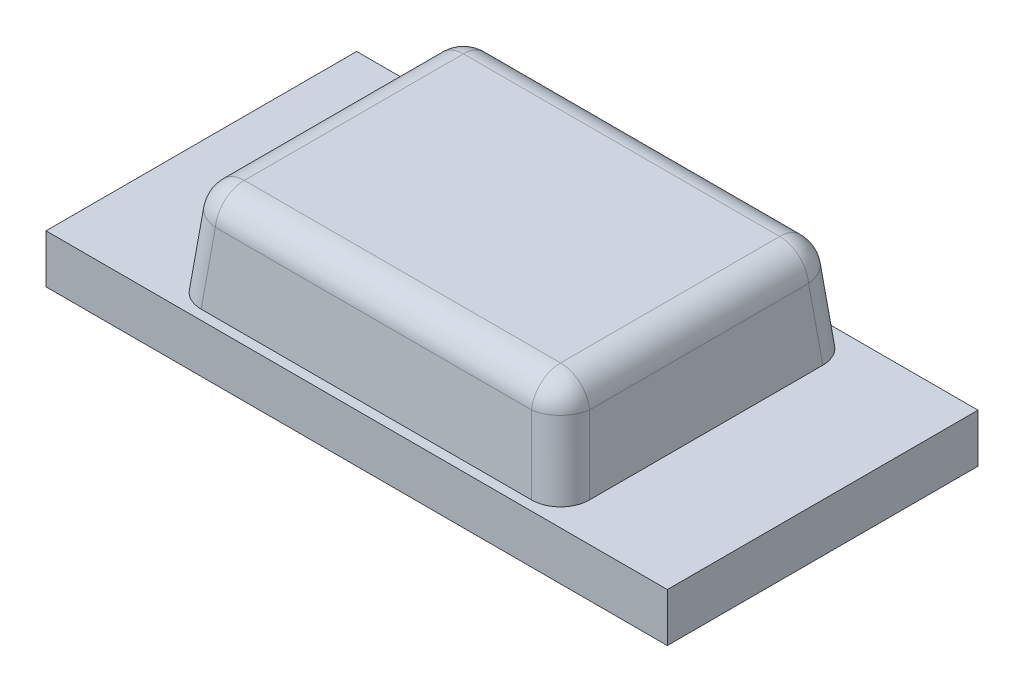
ISO-10303-21;
HEADER;
FILE_DESCRIPTION(('STEP AP214'),'2;1');
FILE_NAME('part.step','',(''),(''),'','','');
FILE_SCHEMA(('AUTOMOTIVE_DESIGN { 1 0 10303 214 1 1 1 1 }'));
ENDSEC;
DATA;
#1=APPLICATION_CONTEXT('core data for automotive mechanical design processes');
#2=APPLICATION_PROTOCOL_DEFINITION('international standard','automotive_design',2000,#1);
#3=PRODUCT_CONTEXT('',#1,'mechanical');
#4=PRODUCT('Part','Part','',(#3));
#5=PRODUCT_RELATED_PRODUCT_CATEGORY('part','',(#4));
#6=PRODUCT_DEFINITION_FORMATION('','',#4);
#7=PRODUCT_DEFINITION_CONTEXT('part definition',#1,'design');
#8=PRODUCT_DEFINITION('design','',#6,#7);
#9=PRODUCT_DEFINITION_SHAPE('','',#8);
#10=(LENGTH_UNIT() NAMED_UNIT(*) SI_UNIT(.MILLI.,.METRE.));
#11=(NAMED_UNIT(*) PLANE_ANGLE_UNIT() SI_UNIT($,.RADIAN.));
#12=(NAMED_UNIT(*) SI_UNIT($,.STERADIAN.) SOLID_ANGLE_UNIT());
#13=UNCERTAINTY_MEASURE_WITH_UNIT(LENGTH_MEASURE(1.E-05),#10,'distance_accuracy_value','');
#14=(GEOMETRIC_REPRESENTATION_CONTEXT(3) GLOBAL_UNCERTAINTY_ASSIGNED_CONTEXT((#13)) GLOBAL_UNIT_ASSIGNED_CONTEXT((#10,
#11,#12)) REPRESENTATION_CONTEXT('',''));
#15=CARTESIAN_POINT('',(0.,0.,0.));
#16=DIRECTION('',(0.,0.,1.));
#17=DIRECTION('',(1.,0.,0.));
#18=AXIS2_PLACEMENT_3D('',#15,#16,#17);
#19=CARTESIAN_POINT('',(0.,0.25,0.));
#20=DIRECTION('',(0.,-1.,0.));
#21=DIRECTION('',(0.,0.,-1.));
#22=AXIS2_PLACEMENT_3D('',#19,#20,#21);
#23=PLANE('',#22);
#24=DIRECTION('',(0.,0.,-1.));
#25=VECTOR('',#24,1.);
#26=CARTESIAN_POINT('',(1.6,0.25,0.799999999999998));
#27=LINE('',#26,#25);
#28=CARTESIAN_POINT('',(1.6,0.25,0.799999999999998));
#29=VERTEX_POINT('',#28);
#30=CARTESIAN_POINT('',(1.6,0.25,-0.800000000000002));
#31=VERTEX_POINT('',#30);
#32=EDGE_CURVE('E145',#29,#31,#27,.T.);
#33=ORIENTED_EDGE('',*,*,#32,.T.);
#34=DIRECTION('',(-1.,0.,0.));
#35=VECTOR('',#34,1.);
#36=CARTESIAN_POINT('',(-1.6,0.25,-0.800000000000002));
#37=LINE('',#36,#35);
#38=CARTESIAN_POINT('',(-1.6,0.25,-0.800000000000002));
#39=VERTEX_POINT('',#38);
#40=EDGE_CURVE('E134',#31,#39,#37,.T.);
#41=ORIENTED_EDGE('',*,*,#40,.T.);
#42=DIRECTION('',(0.,0.,1.));
#43=VECTOR('',#42,1.);
#44=CARTESIAN_POINT('',(-1.6,0.25,0.799999999999998));
#45=LINE('',#44,#43);
#46=CARTESIAN_POINT('',(-1.6,0.25,0.799999999999998));
#47=VERTEX_POINT('',#46);
#48=EDGE_CURVE('E144',#39,#47,#45,.T.);
#49=ORIENTED_EDGE('',*,*,#48,.T.);
#50=DIRECTION('',(1.,0.,0.));
#51=VECTOR('',#50,1.);
#52=CARTESIAN_POINT('',(-1.6,0.25,0.799999999999998));
#53=LINE('',#52,#51);
#54=EDGE_CURVE('E150',#47,#29,#53,.T.);
#55=ORIENTED_EDGE('',*,*,#54,.T.);
#56=EDGE_LOOP('',(#33,#41,#49,#55));
#57=FACE_BOUND('',#56,.T.);
#58=DIRECTION('',(0.,0.,-1.));
#59=VECTOR('',#58,1.);
#60=CARTESIAN_POINT('',(1.,0.25,0.750000000000002));
#61=LINE('',#60,#59);
#62=CARTESIAN_POINT('',(1.,0.25,0.600744266964108));
#63=VERTEX_POINT('',#62);
#64=CARTESIAN_POINT('',(1.,0.25,-0.600744266964107));
#65=VERTEX_POINT('',#64);
#66=EDGE_CURVE('E234',#63,#65,#61,.T.);
#67=ORIENTED_EDGE('',*,*,#66,.F.);
#68=CARTESIAN_POINT('',(0.849252021732466,0.25,0.599252021732468));
#69=DIRECTION('',(0.,-1.,0.));
#70=DIRECTION('',(0.707106781186548,0.,0.707106781186548));
#71=AXIS2_PLACEMENT_3D('',#68,#69,#70);
#72=ELLIPSE('',#71,0.151492263510379,0.15);
#73=CARTESIAN_POINT('',(0.850744266964105,0.25,0.750000000000002));
#74=VERTEX_POINT('',#73);
#75=EDGE_CURVE('E41',#63,#74,#72,.T.);
#76=ORIENTED_EDGE('',*,*,#75,.T.);
#77=DIRECTION('',(1.,0.,0.));
#78=VECTOR('',#77,1.);
#79=CARTESIAN_POINT('',(-1.,0.25,0.750000000000002));
#80=LINE('',#79,#78);
#81=CARTESIAN_POINT('',(-0.850744266964105,0.25,0.750000000000002));
#82=VERTEX_POINT('',#81);
#83=EDGE_CURVE('E245',#82,#74,#80,.T.);
#84=ORIENTED_EDGE('',*,*,#83,.F.);
#85=CARTESIAN_POINT('',(-0.849252021732466,0.25,0.599252021732468));
#86=DIRECTION('',(0.,-1.,0.));
#87=DIRECTION('',(-0.707106781186548,0.,0.707106781186548));
#88=AXIS2_PLACEMENT_3D('',#85,#86,#87);
#89=ELLIPSE('',#88,0.151492263510379,0.15);
#90=CARTESIAN_POINT('',(-1.,0.25,0.600744266964108));
#91=VERTEX_POINT('',#90);
#92=EDGE_CURVE('E11',#82,#91,#89,.T.);
#93=ORIENTED_EDGE('',*,*,#92,.T.);
#94=DIRECTION('',(0.,0.,1.));
#95=VECTOR('',#94,1.);
#96=CARTESIAN_POINT('',(-1.,0.25,0.750000000000002));
#97=LINE('',#96,#95);
#98=CARTESIAN_POINT('',(-1.,0.25,-0.600744266964107));
#99=VERTEX_POINT('',#98);
#100=EDGE_CURVE('E240',#99,#91,#97,.T.);
#101=ORIENTED_EDGE('',*,*,#100,.F.);
#102=CARTESIAN_POINT('',(-0.849252021732466,0.25,-0.599252021732468));
#103=DIRECTION('',(0.,-1.,0.));
#104=DIRECTION('',(-0.707106781186548,0.,-0.707106781186548));
#105=AXIS2_PLACEMENT_3D('',#102,#103,#104);
#106=ELLIPSE('',#105,0.151492263510379,0.15);
#107=CARTESIAN_POINT('',(-0.850744266964105,0.25,-0.750000000000002));
#108=VERTEX_POINT('',#107);
#109=EDGE_CURVE('E196',#99,#108,#106,.T.);
#110=ORIENTED_EDGE('',*,*,#109,.T.);
#111=DIRECTION('',(-1.,0.,0.));
#112=VECTOR('',#111,1.);
#113=CARTESIAN_POINT('',(-1.,0.25,-0.750000000000002));
#114=LINE('',#113,#112);
#115=CARTESIAN_POINT('',(0.850744266964105,0.25,-0.750000000000002));
#116=VERTEX_POINT('',#115);
#117=EDGE_CURVE('E236',#116,#108,#114,.T.);
#118=ORIENTED_EDGE('',*,*,#117,.F.);
#119=CARTESIAN_POINT('',(0.849252021732466,0.25,-0.599252021732468));
#120=DIRECTION('',(0.,-1.,0.));
#121=DIRECTION('',(0.707106781186548,0.,-0.707106781186548));
#122=AXIS2_PLACEMENT_3D('',#119,#120,#121);
#123=ELLIPSE('',#122,0.151492263510379,0.15);
#124=EDGE_CURVE('E198',#116,#65,#123,.T.);
#125=ORIENTED_EDGE('',*,*,#124,.T.);
#126=EDGE_LOOP('',(#67,#76,#84,#93,#101,#110,#118,#125));
#127=FACE_BOUND('',#126,.T.);
#128=ADVANCED_FACE('F32',(#57,#127),#23,.F.);
#129=CARTESIAN_POINT('',(1.6,0.25,0.799999999999998));
#130=DIRECTION('',(-1.,0.,0.));
#131=DIRECTION('',(0.,0.,1.));
#132=AXIS2_PLACEMENT_3D('',#129,#130,#131);
#133=PLANE('',#132);
#134=DIRECTION('',(0.,0.,-1.));
#135=VECTOR('',#134,1.);
#136=CARTESIAN_POINT('',(1.6,0.,0.799999999999998));
#137=LINE('',#136,#135);
#138=CARTESIAN_POINT('',(1.6,0.,0.799999999999998));
#139=VERTEX_POINT('',#138);
#140=CARTESIAN_POINT('',(1.6,0.,-0.800000000000002));
#141=VERTEX_POINT('',#140);
#142=EDGE_CURVE('E158',#139,#141,#137,.T.);
#143=ORIENTED_EDGE('',*,*,#142,.T.);
#144=DIRECTION('',(0.,-1.,0.));
#145=VECTOR('',#144,1.);
#146=CARTESIAN_POINT('',(1.6,0.25,-0.800000000000002));
#147=LINE('',#146,#145);
#148=EDGE_CURVE('E138',#31,#141,#147,.T.);
#149=ORIENTED_EDGE('',*,*,#148,.F.);
#150=ORIENTED_EDGE('',*,*,#32,.F.);
#151=DIRECTION('',(0.,-1.,0.));
#152=VECTOR('',#151,1.);
#153=CARTESIAN_POINT('',(1.6,0.25,0.799999999999998));
#154=LINE('',#153,#152);
#155=EDGE_CURVE('E250',#29,#139,#154,.T.);
#156=ORIENTED_EDGE('',*,*,#155,.T.);
#157=EDGE_LOOP('',(#143,#149,#150,#156));
#158=FACE_BOUND('',#157,.T.);
#159=ADVANCED_FACE('F156',(#158),#133,.F.);
#160=CARTESIAN_POINT('',(-1.6,0.25,-0.800000000000002));
#161=DIRECTION('',(0.,0.,1.));
#162=DIRECTION('',(1.,0.,0.));
#163=AXIS2_PLACEMENT_3D('',#160,#161,#162);
#164=PLANE('',#163);
#165=DIRECTION('',(-1.,0.,0.));
#166=VECTOR('',#165,1.);
#167=CARTESIAN_POINT('',(-1.6,0.,-0.800000000000002));
#168=LINE('',#167,#166);
#169=CARTESIAN_POINT('',(-1.6,0.,-0.800000000000002));
#170=VERTEX_POINT('',#169);
#171=EDGE_CURVE('E252',#141,#170,#168,.T.);
#172=ORIENTED_EDGE('',*,*,#171,.T.);
#173=DIRECTION('',(0.,-1.,0.));
#174=VECTOR('',#173,1.);
#175=CARTESIAN_POINT('',(-1.6,0.25,-0.800000000000002));
#176=LINE('',#175,#174);
#177=EDGE_CURVE('E141',#39,#170,#176,.T.);
#178=ORIENTED_EDGE('',*,*,#177,.F.);
#179=ORIENTED_EDGE('',*,*,#40,.F.);
#180=ORIENTED_EDGE('',*,*,#148,.T.);
#181=EDGE_LOOP('',(#172,#178,#179,#180));
#182=FACE_BOUND('',#181,.T.);
#183=ADVANCED_FACE('F136',(#182),#164,.F.);
#184=CARTESIAN_POINT('',(-1.6,0.25,0.799999999999998));
#185=DIRECTION('',(1.,0.,0.));
#186=DIRECTION('',(0.,0.,-1.));
#187=AXIS2_PLACEMENT_3D('',#184,#185,#186);
#188=PLANE('',#187);
#189=DIRECTION('',(0.,0.,1.));
#190=VECTOR('',#189,1.);
#191=CARTESIAN_POINT('',(-1.6,0.,0.799999999999998));
#192=LINE('',#191,#190);
#193=CARTESIAN_POINT('',(-1.6,0.,0.799999999999998));
#194=VERTEX_POINT('',#193);
#195=EDGE_CURVE('E254',#170,#194,#192,.T.);
#196=ORIENTED_EDGE('',*,*,#195,.T.);
#197=DIRECTION('',(0.,-1.,0.));
#198=VECTOR('',#197,1.);
#199=CARTESIAN_POINT('',(-1.6,0.25,0.799999999999998));
#200=LINE('',#199,#198);
#201=EDGE_CURVE('E163',#47,#194,#200,.T.);
#202=ORIENTED_EDGE('',*,*,#201,.F.);
#203=ORIENTED_EDGE('',*,*,#48,.F.);
#204=ORIENTED_EDGE('',*,*,#177,.T.);
#205=EDGE_LOOP('',(#196,#202,#203,#204));
#206=FACE_BOUND('',#205,.T.);
#207=ADVANCED_FACE('F266',(#206),#188,.F.);
#208=CARTESIAN_POINT('',(-1.6,0.25,0.799999999999998));
#209=DIRECTION('',(0.,0.,-1.));
#210=DIRECTION('',(-1.,0.,0.));
#211=AXIS2_PLACEMENT_3D('',#208,#209,#210);
#212=PLANE('',#211);
#213=DIRECTION('',(1.,0.,0.));
#214=VECTOR('',#213,1.);
#215=CARTESIAN_POINT('',(-1.6,0.,0.799999999999998));
#216=LINE('',#215,#214);
#217=EDGE_CURVE('E154',#194,#139,#216,.T.);
#218=ORIENTED_EDGE('',*,*,#217,.T.);
#219=ORIENTED_EDGE('',*,*,#155,.F.);
#220=ORIENTED_EDGE('',*,*,#54,.F.);
#221=ORIENTED_EDGE('',*,*,#201,.T.);
#222=EDGE_LOOP('',(#218,#219,#220,#221));
#223=FACE_BOUND('',#222,.T.);
#224=ADVANCED_FACE('F261',(#223),#212,.F.);
#225=CARTESIAN_POINT('',(0.,0.,0.));
#226=DIRECTION('',(0.,-1.,0.));
#227=DIRECTION('',(0.,0.,-1.));
#228=AXIS2_PLACEMENT_3D('',#225,#226,#227);
#229=PLANE('',#228);
#230=ORIENTED_EDGE('',*,*,#142,.F.);
#231=ORIENTED_EDGE('',*,*,#217,.F.);
#232=ORIENTED_EDGE('',*,*,#195,.F.);
#233=ORIENTED_EDGE('',*,*,#171,.F.);
#234=EDGE_LOOP('',(#230,#231,#232,#233));
#235=FACE_BOUND('',#234,.T.);
#236=ADVANCED_FACE('F265',(#235),#229,.T.);
#237=CARTESIAN_POINT('',(1.,0.25,0.750000000000002));
#238=DIRECTION('',(0.995038220239298,0.0994934181893926,0.));
#239=DIRECTION('',(-0.0994934181893926,0.995038220239299,0.));
#240=AXIS2_PLACEMENT_3D('',#237,#238,#239);
#241=PLANE('',#240);
#242=ORIENTED_EDGE('',*,*,#66,.T.);
#243=DIRECTION('',(-0.0990046045615373,0.990149572817778,0.0990046045615372));
#244=VECTOR('',#243,1.);
#245=CARTESIAN_POINT('',(0.986760123932997,0.382412605352665,-0.587504390897104));
#246=LINE('',#245,#244);
#247=CARTESIAN_POINT('',(0.96351141426808,0.614924012728409,-0.564255681232188));
#248=VERTEX_POINT('',#247);
#249=EDGE_CURVE('E49',#65,#248,#246,.T.);
#250=ORIENTED_EDGE('',*,*,#249,.T.);
#251=DIRECTION('',(0.,0.,-1.));
#252=VECTOR('',#251,1.);
#253=CARTESIAN_POINT('',(0.96351141426808,0.614924012728409,0.750000000000002));
#254=LINE('',#253,#252);
#255=CARTESIAN_POINT('',(0.96351141426808,0.614924012728409,0.564255681232188));
#256=VERTEX_POINT('',#255);
#257=EDGE_CURVE('E54',#248,#256,#254,.F.);
#258=ORIENTED_EDGE('',*,*,#257,.T.);
#259=DIRECTION('',(-0.0990046045615373,0.990149572817778,-0.0990046045615372));
#260=VECTOR('',#259,1.);
#261=CARTESIAN_POINT('',(1.00146299151958,0.235368554982266,0.602207258483684));
#262=LINE('',#261,#260);
#263=EDGE_CURVE('E192',#256,#63,#262,.F.);
#264=ORIENTED_EDGE('',*,*,#263,.T.);
#265=EDGE_LOOP('',(#242,#250,#258,#264));
#266=FACE_BOUND('',#265,.T.);
#267=ADVANCED_FACE('F286',(#266),#241,.T.);
#268=CARTESIAN_POINT('',(-1.,0.25,-0.750000000000002));
#269=DIRECTION('',(0.,0.0994934181893926,-0.995038220239298));
#270=DIRECTION('',(0.,0.995038220239299,0.0994934181893926));
#271=AXIS2_PLACEMENT_3D('',#268,#269,#270);
#272=PLANE('',#271);
#273=ORIENTED_EDGE('',*,*,#117,.T.);
#274=DIRECTION('',(0.0990046045615372,0.990149572817778,0.0990046045615372));
#275=VECTOR('',#274,1.);
#276=CARTESIAN_POINT('',(-0.852207258483682,0.235368554982266,-0.751462991519579));
#277=LINE('',#276,#275);
#278=CARTESIAN_POINT('',(-0.814255681232185,0.614924012728409,-0.713511414268082));
#279=VERTEX_POINT('',#278);
#280=EDGE_CURVE('E190',#108,#279,#277,.T.);
#281=ORIENTED_EDGE('',*,*,#280,.T.);
#282=DIRECTION('',(-1.,0.,0.));
#283=VECTOR('',#282,1.);
#284=CARTESIAN_POINT('',(-1.,0.614924012728409,-0.713511414268082));
#285=LINE('',#284,#283);
#286=CARTESIAN_POINT('',(0.814255681232186,0.614924012728409,-0.713511414268082));
#287=VERTEX_POINT('',#286);
#288=EDGE_CURVE('E188',#279,#287,#285,.F.);
#289=ORIENTED_EDGE('',*,*,#288,.T.);
#290=DIRECTION('',(-0.0990046045615372,0.990149572817778,0.0990046045615372));
#291=VECTOR('',#290,1.);
#292=CARTESIAN_POINT('',(0.832603435034909,0.431427288809464,-0.731859168070806));
#293=LINE('',#292,#291);
#294=EDGE_CURVE('E186',#287,#116,#293,.F.);
#295=ORIENTED_EDGE('',*,*,#294,.T.);
#296=EDGE_LOOP('',(#273,#281,#289,#295));
#297=FACE_BOUND('',#296,.T.);
#298=ADVANCED_FACE('F283',(#297),#272,.T.);
#299=CARTESIAN_POINT('',(-1.,0.25,0.750000000000002));
#300=DIRECTION('',(-0.995038220239298,0.0994934181893926,0.));
#301=DIRECTION('',(-0.0994934181893926,-0.995038220239299,0.));
#302=AXIS2_PLACEMENT_3D('',#299,#300,#301);
#303=PLANE('',#302);
#304=DIRECTION('',(0.,0.,1.));
#305=VECTOR('',#304,1.);
#306=CARTESIAN_POINT('',(-0.96351141426808,0.614924012728409,0.750000000000002));
#307=LINE('',#306,#305);
#308=CARTESIAN_POINT('',(-0.96351141426808,0.614924012728409,0.564255681232188));
#309=VERTEX_POINT('',#308);
#310=CARTESIAN_POINT('',(-0.96351141426808,0.614924012728409,-0.564255681232188));
#311=VERTEX_POINT('',#310);
#312=EDGE_CURVE('E182',#309,#311,#307,.F.);
#313=ORIENTED_EDGE('',*,*,#312,.T.);
#314=DIRECTION('',(0.0990046045615373,0.990149572817778,0.0990046045615372));
#315=VECTOR('',#314,1.);
#316=CARTESIAN_POINT('',(-0.986760123932997,0.382412605352665,-0.587504390897105));
#317=LINE('',#316,#315);
#318=EDGE_CURVE('E184',#311,#99,#317,.F.);
#319=ORIENTED_EDGE('',*,*,#318,.T.);
#320=ORIENTED_EDGE('',*,*,#100,.T.);
#321=DIRECTION('',(0.0990046045615373,0.990149572817778,-0.0990046045615372));
#322=VECTOR('',#321,1.);
#323=CARTESIAN_POINT('',(-1.00146299151958,0.235368554982266,0.602207258483684));
#324=LINE('',#323,#322);
#325=EDGE_CURVE('E180',#91,#309,#324,.T.);
#326=ORIENTED_EDGE('',*,*,#325,.T.);
#327=EDGE_LOOP('',(#313,#319,#320,#326));
#328=FACE_BOUND('',#327,.T.);
#329=ADVANCED_FACE('F294',(#328),#303,.T.);
#330=CARTESIAN_POINT('',(-1.,0.25,0.750000000000002));
#331=DIRECTION('',(0.,0.0994934181893926,0.995038220239298));
#332=DIRECTION('',(0.,-0.995038220239299,0.0994934181893926));
#333=AXIS2_PLACEMENT_3D('',#330,#331,#332);
#334=PLANE('',#333);
#335=ORIENTED_EDGE('',*,*,#83,.T.);
#336=DIRECTION('',(-0.0990046045615372,0.990149572817778,-0.0990046045615372));
#337=VECTOR('',#336,1.);
#338=CARTESIAN_POINT('',(0.832603435034909,0.431427288809464,0.731859168070806));
#339=LINE('',#338,#337);
#340=CARTESIAN_POINT('',(0.814255681232185,0.614924012728409,0.713511414268082));
#341=VERTEX_POINT('',#340);
#342=EDGE_CURVE('E178',#74,#341,#339,.T.);
#343=ORIENTED_EDGE('',*,*,#342,.T.);
#344=DIRECTION('',(1.,0.,0.));
#345=VECTOR('',#344,1.);
#346=CARTESIAN_POINT('',(-1.,0.614924012728409,0.713511414268082));
#347=LINE('',#346,#345);
#348=CARTESIAN_POINT('',(-0.814255681232185,0.614924012728409,0.713511414268082));
#349=VERTEX_POINT('',#348);
#350=EDGE_CURVE('E175',#341,#349,#347,.F.);
#351=ORIENTED_EDGE('',*,*,#350,.T.);
#352=DIRECTION('',(0.0990046045615372,0.990149572817778,-0.0990046045615372));
#353=VECTOR('',#352,1.);
#354=CARTESIAN_POINT('',(-0.852207258483682,0.235368554982266,0.751462991519579));
#355=LINE('',#354,#353);
#356=EDGE_CURVE('E173',#349,#82,#355,.F.);
#357=ORIENTED_EDGE('',*,*,#356,.T.);
#358=EDGE_LOOP('',(#335,#343,#351,#357));
#359=FACE_BOUND('',#358,.T.);
#360=ADVANCED_FACE('F299',(#359),#334,.T.);
#361=CARTESIAN_POINT('',(0.,0.75,0.));
#362=DIRECTION('',(0.,-1.,0.));
#363=DIRECTION('',(0.,0.,-1.));
#364=AXIS2_PLACEMENT_3D('',#361,#362,#363);
#365=PLANE('',#364);
#366=DIRECTION('',(0.,0.,-1.));
#367=VECTOR('',#366,1.);
#368=CARTESIAN_POINT('',(-0.814255681232185,0.75,0.));
#369=LINE('',#368,#367);
#370=CARTESIAN_POINT('',(-0.814255681232185,0.75,-0.564255681232187));
#371=VERTEX_POINT('',#370);
#372=CARTESIAN_POINT('',(-0.814255681232185,0.75,0.564255681232188));
#373=VERTEX_POINT('',#372);
#374=EDGE_CURVE('E168',#371,#373,#369,.F.);
#375=ORIENTED_EDGE('',*,*,#374,.T.);
#376=DIRECTION('',(-1.,0.,0.));
#377=VECTOR('',#376,1.);
#378=CARTESIAN_POINT('',(0.,0.75,0.564255681232188));
#379=LINE('',#378,#377);
#380=CARTESIAN_POINT('',(0.814255681232185,0.75,0.564255681232188));
#381=VERTEX_POINT('',#380);
#382=EDGE_CURVE('E170',#373,#381,#379,.F.);
#383=ORIENTED_EDGE('',*,*,#382,.T.);
#384=DIRECTION('',(0.,0.,1.));
#385=VECTOR('',#384,1.);
#386=CARTESIAN_POINT('',(0.814255681232185,0.75,0.));
#387=LINE('',#386,#385);
#388=CARTESIAN_POINT('',(0.814255681232185,0.75,-0.564255681232187));
#389=VERTEX_POINT('',#388);
#390=EDGE_CURVE('E159',#381,#389,#387,.F.);
#391=ORIENTED_EDGE('',*,*,#390,.T.);
#392=DIRECTION('',(1.,0.,0.));
#393=VECTOR('',#392,1.);
#394=CARTESIAN_POINT('',(0.,0.75,-0.564255681232187));
#395=LINE('',#394,#393);
#396=EDGE_CURVE('E161',#389,#371,#395,.F.);
#397=ORIENTED_EDGE('',*,*,#396,.T.);
#398=EDGE_LOOP('',(#375,#383,#391,#397));
#399=FACE_BOUND('',#398,.T.);
#400=ADVANCED_FACE('F298',(#399),#365,.F.);
#401=CARTESIAN_POINT('',(-0.837504390897102,0.367488592624256,-0.587504390897104));
#402=DIRECTION('',(-0.0990046045615372,-0.990149572817777,-0.0990046045615372));
#403=DIRECTION('',(0.,0.0994934181893926,-0.995038220239299));
#404=AXIS2_PLACEMENT_3D('',#401,#402,#403);
#405=CYLINDRICAL_SURFACE('',#404,0.15);
#406=ORIENTED_EDGE('',*,*,#109,.F.);
#407=ORIENTED_EDGE('',*,*,#318,.F.);
#408=CARTESIAN_POINT('',(-0.814255681232185,0.6,-0.564255681232187));
#409=DIRECTION('',(0.0990046045615369,0.990149572817778,0.099004604561537));
#410=DIRECTION('',(0.,-0.0994934181893923,0.995038220239299));
#411=AXIS2_PLACEMENT_3D('',#408,#409,#410);
#412=CIRCLE('',#411,0.15);
#413=EDGE_CURVE('E36',#279,#311,#412,.T.);
#414=ORIENTED_EDGE('',*,*,#413,.F.);
#415=ORIENTED_EDGE('',*,*,#280,.F.);
#416=EDGE_LOOP('',(#406,#407,#414,#415));
#417=FACE_BOUND('',#416,.T.);
#418=ADVANCED_FACE('F34',(#417),#405,.T.);
#419=CARTESIAN_POINT('',(0.,0.6,-0.564255681232187));
#420=DIRECTION('',(1.,0.,0.));
#421=DIRECTION('',(0.,0.,-1.));
#422=AXIS2_PLACEMENT_3D('',#419,#420,#421);
#423=CYLINDRICAL_SURFACE('',#422,0.15);
#424=CARTESIAN_POINT('',(0.814255681232186,0.6,-0.564255681232187));
#425=DIRECTION('',(1.,0.,0.));
#426=DIRECTION('',(0.,1.,0.));
#427=AXIS2_PLACEMENT_3D('',#424,#425,#426);
#428=CIRCLE('',#427,0.15);
#429=EDGE_CURVE('E226',#287,#389,#428,.T.);
#430=ORIENTED_EDGE('',*,*,#429,.F.);
#431=ORIENTED_EDGE('',*,*,#288,.F.);
#432=CARTESIAN_POINT('',(-0.814255681232185,0.6,-0.564255681232187));
#433=DIRECTION('',(-1.,0.,0.));
#434=DIRECTION('',(0.,0.,1.));
#435=AXIS2_PLACEMENT_3D('',#432,#433,#434);
#436=CIRCLE('',#435,0.15);
#437=EDGE_CURVE('E228',#371,#279,#436,.T.);
#438=ORIENTED_EDGE('',*,*,#437,.F.);
#439=ORIENTED_EDGE('',*,*,#396,.F.);
#440=EDGE_LOOP('',(#430,#431,#438,#439));
#441=FACE_BOUND('',#440,.T.);
#442=ADVANCED_FACE('F326',(#441),#423,.T.);
#443=CARTESIAN_POINT('',(0.832603435034909,0.416503276081055,-0.582603435034911));
#444=DIRECTION('',(0.0990046045615372,-0.990149572817777,-0.0990046045615372));
#445=DIRECTION('',(0.,0.0994934181893926,-0.995038220239299));
#446=AXIS2_PLACEMENT_3D('',#443,#444,#445);
#447=CYLINDRICAL_SURFACE('',#446,0.15);
#448=ORIENTED_EDGE('',*,*,#124,.F.);
#449=ORIENTED_EDGE('',*,*,#294,.F.);
#450=CARTESIAN_POINT('',(0.814255681232185,0.6,-0.564255681232188));
#451=DIRECTION('',(-0.099004604561537,0.990149572817778,0.0990046045615369));
#452=DIRECTION('',(-0.995038220239299,-0.0994934181893924,0.));
#453=AXIS2_PLACEMENT_3D('',#450,#451,#452);
#454=CIRCLE('',#453,0.15);
#455=EDGE_CURVE('E223',#248,#287,#454,.T.);
#456=ORIENTED_EDGE('',*,*,#455,.F.);
#457=ORIENTED_EDGE('',*,*,#249,.F.);
#458=EDGE_LOOP('',(#448,#449,#456,#457));
#459=FACE_BOUND('',#458,.T.);
#460=ADVANCED_FACE('F322',(#459),#447,.T.);
#461=CARTESIAN_POINT('',(-0.814255681232185,0.6,-0.564255681232187));
#462=DIRECTION('',(0.,0.,1.));
#463=DIRECTION('',(1.,0.,0.));
#464=AXIS2_PLACEMENT_3D('',#461,#462,#463);
#465=SPHERICAL_SURFACE('',#464,0.15);
#466=ORIENTED_EDGE('',*,*,#437,.T.);
#467=ORIENTED_EDGE('',*,*,#413,.T.);
#468=CARTESIAN_POINT('',(-0.814255681232185,0.6,-0.564255681232188));
#469=DIRECTION('',(0.,0.,-1.));
#470=DIRECTION('',(0.,1.,0.));
#471=AXIS2_PLACEMENT_3D('',#468,#469,#470);
#472=CIRCLE('',#471,0.15);
#473=EDGE_CURVE('E220',#371,#311,#472,.F.);
#474=ORIENTED_EDGE('',*,*,#473,.F.);
#475=EDGE_LOOP('',(#466,#467,#474));
#476=FACE_BOUND('',#475,.T.);
#477=ADVANCED_FACE('F356',(#476),#465,.T.);
#478=CARTESIAN_POINT('',(0.814255681232185,0.6,-0.564255681232187));
#479=DIRECTION('',(0.,0.,1.));
#480=DIRECTION('',(1.,0.,0.));
#481=AXIS2_PLACEMENT_3D('',#478,#479,#480);
#482=SPHERICAL_SURFACE('',#481,0.15);
#483=ORIENTED_EDGE('',*,*,#455,.T.);
#484=ORIENTED_EDGE('',*,*,#429,.T.);
#485=CARTESIAN_POINT('',(0.814255681232185,0.6,-0.564255681232187));
#486=DIRECTION('',(0.,0.,-1.));
#487=DIRECTION('',(-1.,0.,0.));
#488=AXIS2_PLACEMENT_3D('',#485,#486,#487);
#489=CIRCLE('',#488,0.15);
#490=EDGE_CURVE('E217',#248,#389,#489,.F.);
#491=ORIENTED_EDGE('',*,*,#490,.F.);
#492=EDGE_LOOP('',(#483,#484,#491));
#493=FACE_BOUND('',#492,.T.);
#494=ADVANCED_FACE('F328',(#493),#482,.T.);
#495=CARTESIAN_POINT('',(-0.852207258483682,0.220444542253857,0.602207258483684));
#496=DIRECTION('',(-0.0990046045615372,-0.990149572817777,0.0990046045615372));
#497=DIRECTION('',(0.,-0.0994934181893926,-0.995038220239299));
#498=AXIS2_PLACEMENT_3D('',#495,#496,#497);
#499=CYLINDRICAL_SURFACE('',#498,0.15);
#500=ORIENTED_EDGE('',*,*,#92,.F.);
#501=ORIENTED_EDGE('',*,*,#356,.F.);
#502=CARTESIAN_POINT('',(-0.814255681232185,0.6,0.564255681232188));
#503=DIRECTION('',(0.099004604561537,0.990149572817778,-0.099004604561537));
#504=DIRECTION('',(0.,0.0994934181893923,0.995038220239299));
#505=AXIS2_PLACEMENT_3D('',#502,#503,#504);
#506=CIRCLE('',#505,0.15);
#507=EDGE_CURVE('E214',#309,#349,#506,.T.);
#508=ORIENTED_EDGE('',*,*,#507,.F.);
#509=ORIENTED_EDGE('',*,*,#325,.F.);
#510=EDGE_LOOP('',(#500,#501,#508,#509));
#511=FACE_BOUND('',#510,.T.);
#512=ADVANCED_FACE('F350',(#511),#499,.T.);
#513=CARTESIAN_POINT('',(-0.814255681232185,0.6,0.));
#514=DIRECTION('',(0.,0.,-1.));
#515=DIRECTION('',(-1.,0.,0.));
#516=AXIS2_PLACEMENT_3D('',#513,#514,#515);
#517=CYLINDRICAL_SURFACE('',#516,0.15);
#518=ORIENTED_EDGE('',*,*,#473,.T.);
#519=ORIENTED_EDGE('',*,*,#312,.F.);
#520=CARTESIAN_POINT('',(-0.814255681232185,0.6,0.564255681232188));
#521=DIRECTION('',(0.,0.,1.));
#522=DIRECTION('',(1.,0.,0.));
#523=AXIS2_PLACEMENT_3D('',#520,#521,#522);
#524=CIRCLE('',#523,0.15);
#525=EDGE_CURVE('E211',#373,#309,#524,.T.);
#526=ORIENTED_EDGE('',*,*,#525,.F.);
#527=ORIENTED_EDGE('',*,*,#374,.F.);
#528=EDGE_LOOP('',(#518,#519,#526,#527));
#529=FACE_BOUND('',#528,.T.);
#530=ADVANCED_FACE('F354',(#529),#517,.T.);
#531=CARTESIAN_POINT('',(0.814255681232185,0.6,0.));
#532=DIRECTION('',(0.,0.,1.));
#533=DIRECTION('',(1.,0.,0.));
#534=AXIS2_PLACEMENT_3D('',#531,#532,#533);
#535=CYLINDRICAL_SURFACE('',#534,0.15);
#536=ORIENTED_EDGE('',*,*,#490,.T.);
#537=ORIENTED_EDGE('',*,*,#390,.F.);
#538=CARTESIAN_POINT('',(0.814255681232185,0.6,0.564255681232188));
#539=DIRECTION('',(0.,0.,1.));
#540=DIRECTION('',(0.,-1.,0.));
#541=AXIS2_PLACEMENT_3D('',#538,#539,#540);
#542=CIRCLE('',#541,0.15);
#543=EDGE_CURVE('E208',#256,#381,#542,.T.);
#544=ORIENTED_EDGE('',*,*,#543,.F.);
#545=ORIENTED_EDGE('',*,*,#257,.F.);
#546=EDGE_LOOP('',(#536,#537,#544,#545));
#547=FACE_BOUND('',#546,.T.);
#548=ADVANCED_FACE('F332',(#547),#535,.T.);
#549=CARTESIAN_POINT('',(0.852207258483682,0.220444542253857,0.602207258483684));
#550=DIRECTION('',(0.0990046045615372,-0.990149572817777,0.0990046045615372));
#551=DIRECTION('',(0.,-0.0994934181893926,-0.995038220239299));
#552=AXIS2_PLACEMENT_3D('',#549,#550,#551);
#553=CYLINDRICAL_SURFACE('',#552,0.15);
#554=ORIENTED_EDGE('',*,*,#75,.F.);
#555=ORIENTED_EDGE('',*,*,#263,.F.);
#556=CARTESIAN_POINT('',(0.814255681232185,0.6,0.564255681232188));
#557=DIRECTION('',(-0.0990046045615369,0.990149572817778,-0.099004604561537));
#558=DIRECTION('',(0.,0.0994934181893923,0.995038220239299));
#559=AXIS2_PLACEMENT_3D('',#556,#557,#558);
#560=CIRCLE('',#559,0.15);
#561=EDGE_CURVE('E205',#341,#256,#560,.T.);
#562=ORIENTED_EDGE('',*,*,#561,.F.);
#563=ORIENTED_EDGE('',*,*,#342,.F.);
#564=EDGE_LOOP('',(#554,#555,#562,#563));
#565=FACE_BOUND('',#564,.T.);
#566=ADVANCED_FACE('F341',(#565),#553,.T.);
#567=CARTESIAN_POINT('',(-0.814255681232185,0.6,0.564255681232188));
#568=DIRECTION('',(0.,0.,1.));
#569=DIRECTION('',(1.,0.,0.));
#570=AXIS2_PLACEMENT_3D('',#567,#568,#569);
#571=SPHERICAL_SURFACE('',#570,0.15);
#572=ORIENTED_EDGE('',*,*,#525,.T.);
#573=ORIENTED_EDGE('',*,*,#507,.T.);
#574=CARTESIAN_POINT('',(-0.814255681232185,0.6,0.564255681232188));
#575=DIRECTION('',(-1.,0.,0.));
#576=DIRECTION('',(0.,0.,1.));
#577=AXIS2_PLACEMENT_3D('',#574,#575,#576);
#578=CIRCLE('',#577,0.15);
#579=EDGE_CURVE('E203',#373,#349,#578,.F.);
#580=ORIENTED_EDGE('',*,*,#579,.F.);
#581=EDGE_LOOP('',(#572,#573,#580));
#582=FACE_BOUND('',#581,.T.);
#583=ADVANCED_FACE('F352',(#582),#571,.T.);
#584=CARTESIAN_POINT('',(0.814255681232185,0.6,0.564255681232188));
#585=DIRECTION('',(0.,0.,1.));
#586=DIRECTION('',(1.,0.,0.));
#587=AXIS2_PLACEMENT_3D('',#584,#585,#586);
#588=SPHERICAL_SURFACE('',#587,0.15);
#589=ORIENTED_EDGE('',*,*,#561,.T.);
#590=ORIENTED_EDGE('',*,*,#543,.T.);
#591=CARTESIAN_POINT('',(0.814255681232185,0.6,0.564255681232188));
#592=DIRECTION('',(1.,0.,0.));
#593=DIRECTION('',(0.,0.,-1.));
#594=AXIS2_PLACEMENT_3D('',#591,#592,#593);
#595=CIRCLE('',#594,0.15);
#596=EDGE_CURVE('E201',#341,#381,#595,.F.);
#597=ORIENTED_EDGE('',*,*,#596,.F.);
#598=EDGE_LOOP('',(#589,#590,#597));
#599=FACE_BOUND('',#598,.T.);
#600=ADVANCED_FACE('F336',(#599),#588,.T.);
#601=CARTESIAN_POINT('',(0.,0.6,0.564255681232188));
#602=DIRECTION('',(-1.,0.,0.));
#603=DIRECTION('',(0.,0.,1.));
#604=AXIS2_PLACEMENT_3D('',#601,#602,#603);
#605=CYLINDRICAL_SURFACE('',#604,0.15);
#606=ORIENTED_EDGE('',*,*,#579,.T.);
#607=ORIENTED_EDGE('',*,*,#350,.F.);
#608=ORIENTED_EDGE('',*,*,#596,.T.);
#609=ORIENTED_EDGE('',*,*,#382,.F.);
#610=EDGE_LOOP('',(#606,#607,#608,#609));
#611=FACE_BOUND('',#610,.T.);
#612=ADVANCED_FACE('F343',(#611),#605,.T.);
#613=CLOSED_SHELL('',(#128,#159,#183,#207,#224,#236,#267,#298,#329,#360,#400,#418,#442,#460,
#477,#494,#512,#530,#548,#566,#583,#600,#612));
#614=MANIFOLD_SOLID_BREP('B2',#613);
#615=ADVANCED_BREP_SHAPE_REPRESENTATION('',(#18,#614),#14);
#616=SHAPE_DEFINITION_REPRESENTATION(#9,#615);
ENDSEC;
END-ISO-10303-21;
